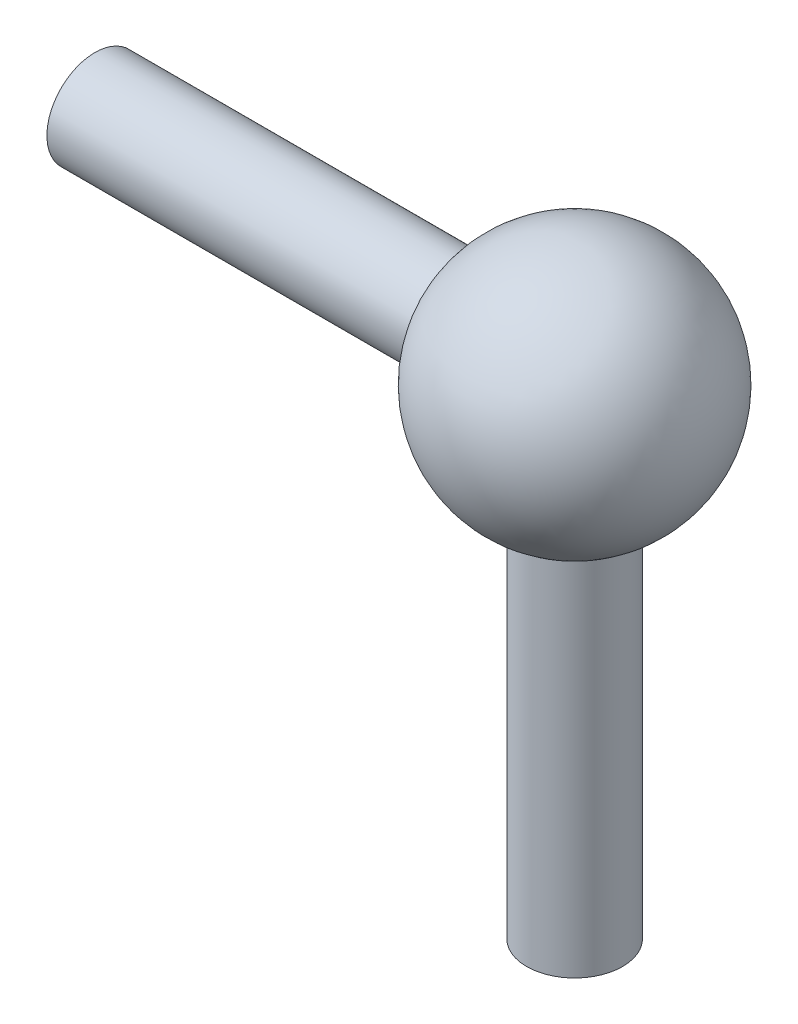
ISO-10303-21;
HEADER;
FILE_DESCRIPTION(('STEP AP214'),'2;1');
FILE_NAME('part.step','',(''),(''),'','','');
FILE_SCHEMA(('AUTOMOTIVE_DESIGN { 1 0 10303 214 1 1 1 1 }'));
ENDSEC;
DATA;
#1=APPLICATION_CONTEXT('core data for automotive mechanical design processes');
#2=APPLICATION_PROTOCOL_DEFINITION('international standard','automotive_design',2000,#1);
#3=PRODUCT_CONTEXT('',#1,'mechanical');
#4=PRODUCT('Part','Part','',(#3));
#5=PRODUCT_RELATED_PRODUCT_CATEGORY('part','',(#4));
#6=PRODUCT_DEFINITION_FORMATION('','',#4);
#7=PRODUCT_DEFINITION_CONTEXT('part definition',#1,'design');
#8=PRODUCT_DEFINITION('design','',#6,#7);
#9=PRODUCT_DEFINITION_SHAPE('','',#8);
#10=(LENGTH_UNIT() NAMED_UNIT(*) SI_UNIT(.MILLI.,.METRE.));
#11=(NAMED_UNIT(*) PLANE_ANGLE_UNIT() SI_UNIT($,.RADIAN.));
#12=(NAMED_UNIT(*) SI_UNIT($,.STERADIAN.) SOLID_ANGLE_UNIT());
#13=UNCERTAINTY_MEASURE_WITH_UNIT(LENGTH_MEASURE(1.E-05),#10,'distance_accuracy_value','');
#14=(GEOMETRIC_REPRESENTATION_CONTEXT(3) GLOBAL_UNCERTAINTY_ASSIGNED_CONTEXT((#13)) GLOBAL_UNIT_ASSIGNED_CONTEXT((#10,
#11,#12)) REPRESENTATION_CONTEXT('',''));
#15=CARTESIAN_POINT('',(0.,0.,0.));
#16=DIRECTION('',(0.,0.,1.));
#17=DIRECTION('',(1.,0.,0.));
#18=AXIS2_PLACEMENT_3D('',#15,#16,#17);
#19=CARTESIAN_POINT('',(0.,0.,0.));
#20=DIRECTION('',(0.,1.,0.));
#21=DIRECTION('',(1.,0.,0.));
#22=AXIS2_PLACEMENT_3D('',#19,#20,#21);
#23=SPHERICAL_SURFACE('',#22,6.5);
#24=CARTESIAN_POINT('',(0.,-6.,0.));
#25=DIRECTION('',(0.,1.,0.));
#26=DIRECTION('',(0.,0.,1.));
#27=AXIS2_PLACEMENT_3D('',#24,#25,#26);
#28=CIRCLE('',#27,2.5);
#29=CARTESIAN_POINT('',(0.,-6.,2.5));
#30=VERTEX_POINT('',#29);
#31=EDGE_CURVE('E10',#30,#30,#28,.F.);
#32=ORIENTED_EDGE('',*,*,#31,.F.);
#33=EDGE_LOOP('',(#32));
#34=FACE_BOUND('',#33,.T.);
#35=CARTESIAN_POINT('',(-6.,0.,0.));
#36=DIRECTION('',(1.,0.,0.));
#37=DIRECTION('',(0.,0.,-1.));
#38=AXIS2_PLACEMENT_3D('',#35,#36,#37);
#39=CIRCLE('',#38,2.5);
#40=CARTESIAN_POINT('',(-6.,0.,-2.5));
#41=VERTEX_POINT('',#40);
#42=EDGE_CURVE('E37',#41,#41,#39,.F.);
#43=ORIENTED_EDGE('',*,*,#42,.F.);
#44=EDGE_LOOP('',(#43));
#45=FACE_BOUND('',#44,.T.);
#46=ADVANCED_FACE('F31',(#34,#45),#23,.T.);
#47=CARTESIAN_POINT('',(-32.0710678118655,0.,0.));
#48=DIRECTION('',(1.,0.,0.));
#49=DIRECTION('',(0.,0.,-1.));
#50=AXIS2_PLACEMENT_3D('',#47,#48,#49);
#51=CYLINDRICAL_SURFACE('',#50,2.5);
#52=ORIENTED_EDGE('',*,*,#42,.T.);
#53=EDGE_LOOP('',(#52));
#54=FACE_BOUND('',#53,.T.);
#55=CARTESIAN_POINT('',(-25.,0.,0.));
#56=DIRECTION('',(1.,0.,0.));
#57=DIRECTION('',(0.,0.,-1.));
#58=AXIS2_PLACEMENT_3D('',#55,#56,#57);
#59=CIRCLE('',#58,2.5);
#60=CARTESIAN_POINT('',(-25.,0.,-2.5));
#61=VERTEX_POINT('',#60);
#62=EDGE_CURVE('E41',#61,#61,#59,.F.);
#63=ORIENTED_EDGE('',*,*,#62,.F.);
#64=EDGE_LOOP('',(#63));
#65=FACE_BOUND('',#64,.T.);
#66=ADVANCED_FACE('F62',(#54,#65),#51,.T.);
#67=CARTESIAN_POINT('',(-25.,0.,0.));
#68=DIRECTION('',(1.,0.,0.));
#69=DIRECTION('',(0.,0.,-1.));
#70=AXIS2_PLACEMENT_3D('',#67,#68,#69);
#71=PLANE('',#70);
#72=ORIENTED_EDGE('',*,*,#62,.T.);
#73=EDGE_LOOP('',(#72));
#74=FACE_BOUND('',#73,.T.);
#75=ADVANCED_FACE('F55',(#74),#71,.F.);
#76=CARTESIAN_POINT('',(0.,-25.,0.));
#77=DIRECTION('',(0.,-1.,0.));
#78=DIRECTION('',(1.,0.,0.));
#79=AXIS2_PLACEMENT_3D('',#76,#77,#78);
#80=PLANE('',#79);
#81=CARTESIAN_POINT('',(0.,-25.,0.));
#82=DIRECTION('',(0.,-1.,0.));
#83=DIRECTION('',(1.,0.,0.));
#84=AXIS2_PLACEMENT_3D('',#81,#82,#83);
#85=CIRCLE('',#84,2.5);
#86=CARTESIAN_POINT('',(2.5,-25.,0.));
#87=VERTEX_POINT('',#86);
#88=EDGE_CURVE('E45',#87,#87,#85,.F.);
#89=ORIENTED_EDGE('',*,*,#88,.F.);
#90=EDGE_LOOP('',(#89));
#91=FACE_BOUND('',#90,.T.);
#92=ADVANCED_FACE('F53',(#91),#80,.T.);
#93=CARTESIAN_POINT('',(0.,-32.0710678118655,0.));
#94=DIRECTION('',(0.,1.,0.));
#95=DIRECTION('',(0.,0.,1.));
#96=AXIS2_PLACEMENT_3D('',#93,#94,#95);
#97=CYLINDRICAL_SURFACE('',#96,2.5);
#98=ORIENTED_EDGE('',*,*,#31,.T.);
#99=EDGE_LOOP('',(#98));
#100=FACE_BOUND('',#99,.T.);
#101=ORIENTED_EDGE('',*,*,#88,.T.);
#102=EDGE_LOOP('',(#101));
#103=FACE_BOUND('',#102,.T.);
#104=ADVANCED_FACE('F51',(#100,#103),#97,.T.);
#105=CLOSED_SHELL('',(#46,#66,#75,#92,#104));
#106=MANIFOLD_SOLID_BREP('B2',#105);
#107=ADVANCED_BREP_SHAPE_REPRESENTATION('',(#18,#106),#14);
#108=SHAPE_DEFINITION_REPRESENTATION(#9,#107);
ENDSEC;
END-ISO-10303-21;
